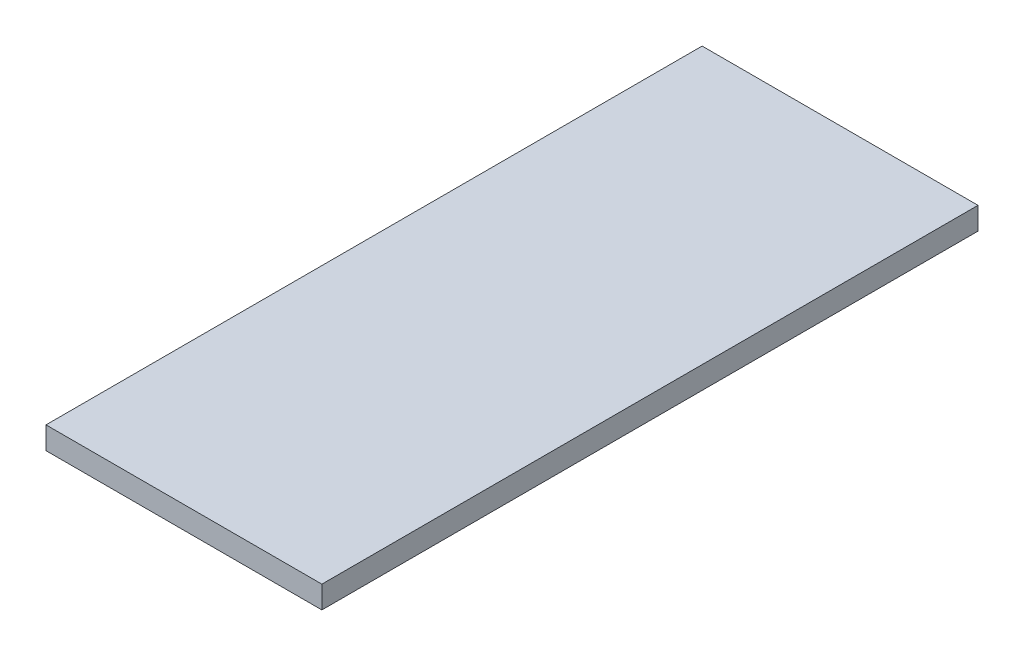
ISO-10303-21;
HEADER;
FILE_DESCRIPTION(('STEP AP214'),'2;1');
FILE_NAME('part.step','',(''),(''),'','','');
FILE_SCHEMA(('AUTOMOTIVE_DESIGN { 1 0 10303 214 1 1 1 1 }'));
ENDSEC;
DATA;
#1=APPLICATION_CONTEXT('core data for automotive mechanical design processes');
#2=APPLICATION_PROTOCOL_DEFINITION('international standard','automotive_design',2000,#1);
#3=PRODUCT_CONTEXT('',#1,'mechanical');
#4=PRODUCT('Part','Part','',(#3));
#5=PRODUCT_RELATED_PRODUCT_CATEGORY('part','',(#4));
#6=PRODUCT_DEFINITION_FORMATION('','',#4);
#7=PRODUCT_DEFINITION_CONTEXT('part definition',#1,'design');
#8=PRODUCT_DEFINITION('design','',#6,#7);
#9=PRODUCT_DEFINITION_SHAPE('','',#8);
#10=(LENGTH_UNIT() NAMED_UNIT(*) SI_UNIT(.MILLI.,.METRE.));
#11=(NAMED_UNIT(*) PLANE_ANGLE_UNIT() SI_UNIT($,.RADIAN.));
#12=(NAMED_UNIT(*) SI_UNIT($,.STERADIAN.) SOLID_ANGLE_UNIT());
#13=UNCERTAINTY_MEASURE_WITH_UNIT(LENGTH_MEASURE(1.E-05),#10,'distance_accuracy_value','');
#14=(GEOMETRIC_REPRESENTATION_CONTEXT(3) GLOBAL_UNCERTAINTY_ASSIGNED_CONTEXT((#13)) GLOBAL_UNIT_ASSIGNED_CONTEXT((#10,
#11,#12)) REPRESENTATION_CONTEXT('',''));
#15=CARTESIAN_POINT('',(0.,0.,0.));
#16=DIRECTION('',(0.,0.,1.));
#17=DIRECTION('',(1.,0.,0.));
#18=AXIS2_PLACEMENT_3D('',#15,#16,#17);
#19=CARTESIAN_POINT('',(0.,3.,-88.));
#20=DIRECTION('',(1.,0.,0.));
#21=DIRECTION('',(0.,0.,-1.));
#22=AXIS2_PLACEMENT_3D('',#19,#20,#21);
#23=PLANE('',#22);
#24=DIRECTION('',(0.,0.,1.));
#25=VECTOR('',#24,1.);
#26=CARTESIAN_POINT('',(0.,0.,-88.));
#27=LINE('',#26,#25);
#28=CARTESIAN_POINT('',(0.,0.,-88.));
#29=VERTEX_POINT('',#28);
#30=CARTESIAN_POINT('',(0.,0.,0.));
#31=VERTEX_POINT('',#30);
#32=EDGE_CURVE('E107',#29,#31,#27,.T.);
#33=ORIENTED_EDGE('',*,*,#32,.T.);
#34=DIRECTION('',(0.,-1.,0.));
#35=VECTOR('',#34,1.);
#36=CARTESIAN_POINT('',(0.,3.,0.));
#37=LINE('',#36,#35);
#38=CARTESIAN_POINT('',(0.,3.,0.));
#39=VERTEX_POINT('',#38);
#40=EDGE_CURVE('E11',#39,#31,#37,.T.);
#41=ORIENTED_EDGE('',*,*,#40,.F.);
#42=DIRECTION('',(0.,0.,1.));
#43=VECTOR('',#42,1.);
#44=CARTESIAN_POINT('',(0.,3.,-88.));
#45=LINE('',#44,#43);
#46=CARTESIAN_POINT('',(0.,3.,-88.));
#47=VERTEX_POINT('',#46);
#48=EDGE_CURVE('E91',#47,#39,#45,.T.);
#49=ORIENTED_EDGE('',*,*,#48,.F.);
#50=DIRECTION('',(0.,-1.,0.));
#51=VECTOR('',#50,1.);
#52=CARTESIAN_POINT('',(0.,3.,-88.));
#53=LINE('',#52,#51);
#54=EDGE_CURVE('E103',#47,#29,#53,.T.);
#55=ORIENTED_EDGE('',*,*,#54,.T.);
#56=EDGE_LOOP('',(#33,#41,#49,#55));
#57=FACE_BOUND('',#56,.T.);
#58=ADVANCED_FACE('F39',(#57),#23,.F.);
#59=CARTESIAN_POINT('',(0.,3.,0.));
#60=DIRECTION('',(0.,0.,-1.));
#61=DIRECTION('',(-1.,0.,0.));
#62=AXIS2_PLACEMENT_3D('',#59,#60,#61);
#63=PLANE('',#62);
#64=DIRECTION('',(1.,0.,0.));
#65=VECTOR('',#64,1.);
#66=CARTESIAN_POINT('',(0.,0.,0.));
#67=LINE('',#66,#65);
#68=CARTESIAN_POINT('',(37.,0.,0.));
#69=VERTEX_POINT('',#68);
#70=EDGE_CURVE('E96',#31,#69,#67,.T.);
#71=ORIENTED_EDGE('',*,*,#70,.T.);
#72=DIRECTION('',(0.,-1.,0.));
#73=VECTOR('',#72,1.);
#74=CARTESIAN_POINT('',(37.,3.,0.));
#75=LINE('',#74,#73);
#76=CARTESIAN_POINT('',(37.,3.,0.));
#77=VERTEX_POINT('',#76);
#78=EDGE_CURVE('E48',#77,#69,#75,.T.);
#79=ORIENTED_EDGE('',*,*,#78,.F.);
#80=DIRECTION('',(1.,0.,0.));
#81=VECTOR('',#80,1.);
#82=CARTESIAN_POINT('',(0.,3.,0.));
#83=LINE('',#82,#81);
#84=EDGE_CURVE('E86',#39,#77,#83,.T.);
#85=ORIENTED_EDGE('',*,*,#84,.F.);
#86=ORIENTED_EDGE('',*,*,#40,.T.);
#87=EDGE_LOOP('',(#71,#79,#85,#86));
#88=FACE_BOUND('',#87,.T.);
#89=ADVANCED_FACE('F95',(#88),#63,.F.);
#90=CARTESIAN_POINT('',(37.,3.,-88.));
#91=DIRECTION('',(-1.,0.,0.));
#92=DIRECTION('',(0.,0.,1.));
#93=AXIS2_PLACEMENT_3D('',#90,#91,#92);
#94=PLANE('',#93);
#95=DIRECTION('',(0.,0.,-1.));
#96=VECTOR('',#95,1.);
#97=CARTESIAN_POINT('',(37.,0.,-88.));
#98=LINE('',#97,#96);
#99=CARTESIAN_POINT('',(37.,0.,-88.));
#100=VERTEX_POINT('',#99);
#101=EDGE_CURVE('E73',#69,#100,#98,.T.);
#102=ORIENTED_EDGE('',*,*,#101,.T.);
#103=DIRECTION('',(0.,-1.,0.));
#104=VECTOR('',#103,1.);
#105=CARTESIAN_POINT('',(37.,3.,-88.));
#106=LINE('',#105,#104);
#107=CARTESIAN_POINT('',(37.,3.,-88.));
#108=VERTEX_POINT('',#107);
#109=EDGE_CURVE('E98',#108,#100,#106,.T.);
#110=ORIENTED_EDGE('',*,*,#109,.F.);
#111=DIRECTION('',(0.,0.,-1.));
#112=VECTOR('',#111,1.);
#113=CARTESIAN_POINT('',(37.,3.,-88.));
#114=LINE('',#113,#112);
#115=EDGE_CURVE('E89',#77,#108,#114,.T.);
#116=ORIENTED_EDGE('',*,*,#115,.F.);
#117=ORIENTED_EDGE('',*,*,#78,.T.);
#118=EDGE_LOOP('',(#102,#110,#116,#117));
#119=FACE_BOUND('',#118,.T.);
#120=ADVANCED_FACE('F99',(#119),#94,.F.);
#121=CARTESIAN_POINT('',(0.,3.,-88.));
#122=DIRECTION('',(0.,0.,1.));
#123=DIRECTION('',(1.,0.,0.));
#124=AXIS2_PLACEMENT_3D('',#121,#122,#123);
#125=PLANE('',#124);
#126=DIRECTION('',(-1.,0.,0.));
#127=VECTOR('',#126,1.);
#128=CARTESIAN_POINT('',(0.,0.,-88.));
#129=LINE('',#128,#127);
#130=EDGE_CURVE('E79',#100,#29,#129,.T.);
#131=ORIENTED_EDGE('',*,*,#130,.T.);
#132=ORIENTED_EDGE('',*,*,#54,.F.);
#133=DIRECTION('',(-1.,0.,0.));
#134=VECTOR('',#133,1.);
#135=CARTESIAN_POINT('',(0.,3.,-88.));
#136=LINE('',#135,#134);
#137=EDGE_CURVE('E56',#108,#47,#136,.T.);
#138=ORIENTED_EDGE('',*,*,#137,.F.);
#139=ORIENTED_EDGE('',*,*,#109,.T.);
#140=EDGE_LOOP('',(#131,#132,#138,#139));
#141=FACE_BOUND('',#140,.T.);
#142=ADVANCED_FACE('F120',(#141),#125,.F.);
#143=CARTESIAN_POINT('',(0.,3.,0.));
#144=DIRECTION('',(0.,1.,0.));
#145=DIRECTION('',(0.,0.,1.));
#146=AXIS2_PLACEMENT_3D('',#143,#144,#145);
#147=PLANE('',#146);
#148=ORIENTED_EDGE('',*,*,#48,.T.);
#149=ORIENTED_EDGE('',*,*,#84,.T.);
#150=ORIENTED_EDGE('',*,*,#115,.T.);
#151=ORIENTED_EDGE('',*,*,#137,.T.);
#152=EDGE_LOOP('',(#148,#149,#150,#151));
#153=FACE_BOUND('',#152,.T.);
#154=ADVANCED_FACE('F87',(#153),#147,.T.);
#155=CARTESIAN_POINT('',(0.,0.,0.));
#156=DIRECTION('',(0.,1.,0.));
#157=DIRECTION('',(0.,0.,1.));
#158=AXIS2_PLACEMENT_3D('',#155,#156,#157);
#159=PLANE('',#158);
#160=ORIENTED_EDGE('',*,*,#32,.F.);
#161=ORIENTED_EDGE('',*,*,#130,.F.);
#162=ORIENTED_EDGE('',*,*,#101,.F.);
#163=ORIENTED_EDGE('',*,*,#70,.F.);
#164=EDGE_LOOP('',(#160,#161,#162,#163));
#165=FACE_BOUND('',#164,.T.);
#166=ADVANCED_FACE('F123',(#165),#159,.F.);
#167=CLOSED_SHELL('',(#58,#89,#120,#142,#154,#166));
#168=MANIFOLD_SOLID_BREP('B2',#167);
#169=ADVANCED_BREP_SHAPE_REPRESENTATION('',(#18,#168),#14);
#170=SHAPE_DEFINITION_REPRESENTATION(#9,#169);
ENDSEC;
END-ISO-10303-21;
